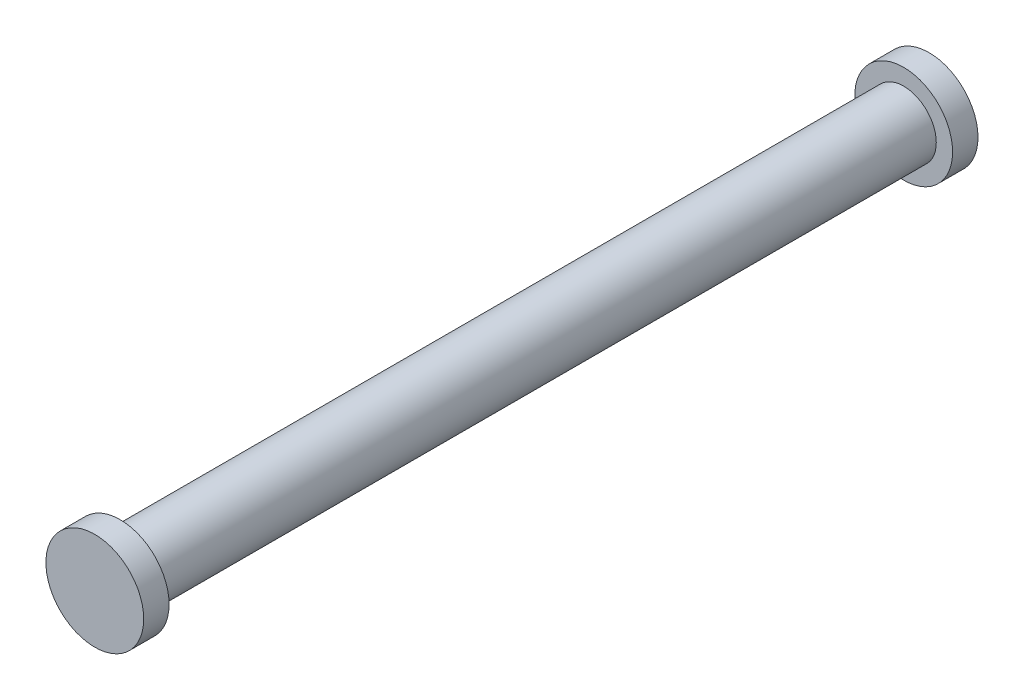
ISO-10303-21;
HEADER;
FILE_DESCRIPTION(('STEP AP214'),'2;1');
FILE_NAME('part.step','',(''),(''),'','','');
FILE_SCHEMA(('AUTOMOTIVE_DESIGN { 1 0 10303 214 1 1 1 1 }'));
ENDSEC;
DATA;
#1=APPLICATION_CONTEXT('core data for automotive mechanical design processes');
#2=APPLICATION_PROTOCOL_DEFINITION('international standard','automotive_design',2000,#1);
#3=PRODUCT_CONTEXT('',#1,'mechanical');
#4=PRODUCT('Part','Part','',(#3));
#5=PRODUCT_RELATED_PRODUCT_CATEGORY('part','',(#4));
#6=PRODUCT_DEFINITION_FORMATION('','',#4);
#7=PRODUCT_DEFINITION_CONTEXT('part definition',#1,'design');
#8=PRODUCT_DEFINITION('design','',#6,#7);
#9=PRODUCT_DEFINITION_SHAPE('','',#8);
#10=(LENGTH_UNIT() NAMED_UNIT(*) SI_UNIT(.MILLI.,.METRE.));
#11=(NAMED_UNIT(*) PLANE_ANGLE_UNIT() SI_UNIT($,.RADIAN.));
#12=(NAMED_UNIT(*) SI_UNIT($,.STERADIAN.) SOLID_ANGLE_UNIT());
#13=UNCERTAINTY_MEASURE_WITH_UNIT(LENGTH_MEASURE(1.E-05),#10,'distance_accuracy_value','');
#14=(GEOMETRIC_REPRESENTATION_CONTEXT(3) GLOBAL_UNCERTAINTY_ASSIGNED_CONTEXT((#13)) GLOBAL_UNIT_ASSIGNED_CONTEXT((#10,
#11,#12)) REPRESENTATION_CONTEXT('',''));
#15=CARTESIAN_POINT('',(0.,0.,0.));
#16=DIRECTION('',(0.,0.,1.));
#17=DIRECTION('',(1.,0.,0.));
#18=AXIS2_PLACEMENT_3D('',#15,#16,#17);
#19=CARTESIAN_POINT('',(0.,0.,128.));
#20=DIRECTION('',(0.,0.,-1.));
#21=DIRECTION('',(-1.,0.,0.));
#22=AXIS2_PLACEMENT_3D('',#19,#20,#21);
#23=CYLINDRICAL_SURFACE('',#22,7.5);
#24=CARTESIAN_POINT('',(0.,0.,0.));
#25=DIRECTION('',(0.,0.,1.));
#26=DIRECTION('',(1.,0.,0.));
#27=AXIS2_PLACEMENT_3D('',#24,#25,#26);
#28=CIRCLE('',#27,7.5);
#29=CARTESIAN_POINT('',(7.5,0.,0.));
#30=VERTEX_POINT('',#29);
#31=EDGE_CURVE('E47',#30,#30,#28,.T.);
#32=ORIENTED_EDGE('',*,*,#31,.T.);
#33=EDGE_LOOP('',(#32));
#34=FACE_BOUND('',#33,.T.);
#35=CARTESIAN_POINT('',(0.,0.,3.9));
#36=DIRECTION('',(0.,0.,1.));
#37=DIRECTION('',(1.,0.,0.));
#38=AXIS2_PLACEMENT_3D('',#35,#36,#37);
#39=CIRCLE('',#38,7.5);
#40=CARTESIAN_POINT('',(7.5,0.,3.9));
#41=VERTEX_POINT('',#40);
#42=EDGE_CURVE('E62',#41,#41,#39,.T.);
#43=ORIENTED_EDGE('',*,*,#42,.F.);
#44=EDGE_LOOP('',(#43));
#45=FACE_BOUND('',#44,.T.);
#46=ADVANCED_FACE('F43',(#34,#45),#23,.T.);
#47=CARTESIAN_POINT('',(0.,0.,0.));
#48=DIRECTION('',(0.,0.,1.));
#49=DIRECTION('',(1.,0.,0.));
#50=AXIS2_PLACEMENT_3D('',#47,#48,#49);
#51=PLANE('',#50);
#52=ORIENTED_EDGE('',*,*,#31,.F.);
#53=EDGE_LOOP('',(#52));
#54=FACE_BOUND('',#53,.T.);
#55=ADVANCED_FACE('F77',(#54),#51,.F.);
#56=CARTESIAN_POINT('',(0.,0.,149.213203435596));
#57=DIRECTION('',(0.,0.,-1.));
#58=DIRECTION('',(-1.,0.,0.));
#59=AXIS2_PLACEMENT_3D('',#56,#57,#58);
#60=CYLINDRICAL_SURFACE('',#59,5.);
#61=CARTESIAN_POINT('',(0.,0.,3.9));
#62=DIRECTION('',(0.,0.,1.));
#63=DIRECTION('',(1.,0.,0.));
#64=AXIS2_PLACEMENT_3D('',#61,#62,#63);
#65=CIRCLE('',#64,5.);
#66=CARTESIAN_POINT('',(5.,0.,3.9));
#67=VERTEX_POINT('',#66);
#68=EDGE_CURVE('E66',#67,#67,#65,.T.);
#69=ORIENTED_EDGE('',*,*,#68,.T.);
#70=EDGE_LOOP('',(#69));
#71=FACE_BOUND('',#70,.T.);
#72=CARTESIAN_POINT('',(0.,0.,124.1));
#73=DIRECTION('',(0.,0.,1.));
#74=DIRECTION('',(1.,0.,0.));
#75=AXIS2_PLACEMENT_3D('',#72,#73,#74);
#76=CIRCLE('',#75,5.);
#77=CARTESIAN_POINT('',(5.,0.,124.1));
#78=VERTEX_POINT('',#77);
#79=EDGE_CURVE('E58',#78,#78,#76,.T.);
#80=ORIENTED_EDGE('',*,*,#79,.F.);
#81=EDGE_LOOP('',(#80));
#82=FACE_BOUND('',#81,.T.);
#83=ADVANCED_FACE('F82',(#71,#82),#60,.T.);
#84=CARTESIAN_POINT('',(0.,0.,3.9));
#85=DIRECTION('',(0.,0.,1.));
#86=DIRECTION('',(1.,0.,0.));
#87=AXIS2_PLACEMENT_3D('',#84,#85,#86);
#88=PLANE('',#87);
#89=ORIENTED_EDGE('',*,*,#68,.F.);
#90=EDGE_LOOP('',(#89));
#91=FACE_BOUND('',#90,.T.);
#92=ORIENTED_EDGE('',*,*,#42,.T.);
#93=EDGE_LOOP('',(#92));
#94=FACE_BOUND('',#93,.T.);
#95=ADVANCED_FACE('F74',(#91,#94),#88,.T.);
#96=CARTESIAN_POINT('',(0.,0.,124.1));
#97=DIRECTION('',(0.,0.,1.));
#98=DIRECTION('',(1.,0.,0.));
#99=AXIS2_PLACEMENT_3D('',#96,#97,#98);
#100=PLANE('',#99);
#101=ORIENTED_EDGE('',*,*,#79,.T.);
#102=EDGE_LOOP('',(#101));
#103=FACE_BOUND('',#102,.T.);
#104=CARTESIAN_POINT('',(0.,0.,124.1));
#105=DIRECTION('',(0.,0.,1.));
#106=DIRECTION('',(1.,0.,0.));
#107=AXIS2_PLACEMENT_3D('',#104,#105,#106);
#108=CIRCLE('',#107,7.5);
#109=CARTESIAN_POINT('',(7.5,0.,124.1));
#110=VERTEX_POINT('',#109);
#111=EDGE_CURVE('E56',#110,#110,#108,.T.);
#112=ORIENTED_EDGE('',*,*,#111,.F.);
#113=EDGE_LOOP('',(#112));
#114=FACE_BOUND('',#113,.T.);
#115=ADVANCED_FACE('F90',(#103,#114),#100,.F.);
#116=CARTESIAN_POINT('',(0.,0.,128.));
#117=DIRECTION('',(0.,0.,1.));
#118=DIRECTION('',(1.,0.,0.));
#119=AXIS2_PLACEMENT_3D('',#116,#117,#118);
#120=PLANE('',#119);
#121=CARTESIAN_POINT('',(0.,0.,128.));
#122=DIRECTION('',(0.,0.,1.));
#123=DIRECTION('',(1.,0.,0.));
#124=AXIS2_PLACEMENT_3D('',#121,#122,#123);
#125=CIRCLE('',#124,7.5);
#126=CARTESIAN_POINT('',(7.5,0.,128.));
#127=VERTEX_POINT('',#126);
#128=EDGE_CURVE('E11',#127,#127,#125,.T.);
#129=ORIENTED_EDGE('',*,*,#128,.T.);
#130=EDGE_LOOP('',(#129));
#131=FACE_BOUND('',#130,.T.);
#132=ADVANCED_FACE('F85',(#131),#120,.T.);
#133=ORIENTED_EDGE('',*,*,#111,.T.);
#134=EDGE_LOOP('',(#133));
#135=FACE_BOUND('',#134,.T.);
#136=ORIENTED_EDGE('',*,*,#128,.F.);
#137=EDGE_LOOP('',(#136));
#138=FACE_BOUND('',#137,.T.);
#139=ADVANCED_FACE('F45',(#135,#138),#23,.T.);
#140=CLOSED_SHELL('',(#46,#55,#83,#95,#115,#132,#139));
#141=MANIFOLD_SOLID_BREP('B2',#140);
#142=ADVANCED_BREP_SHAPE_REPRESENTATION('',(#18,#141),#14);
#143=SHAPE_DEFINITION_REPRESENTATION(#9,#142);
ENDSEC;
END-ISO-10303-21;
